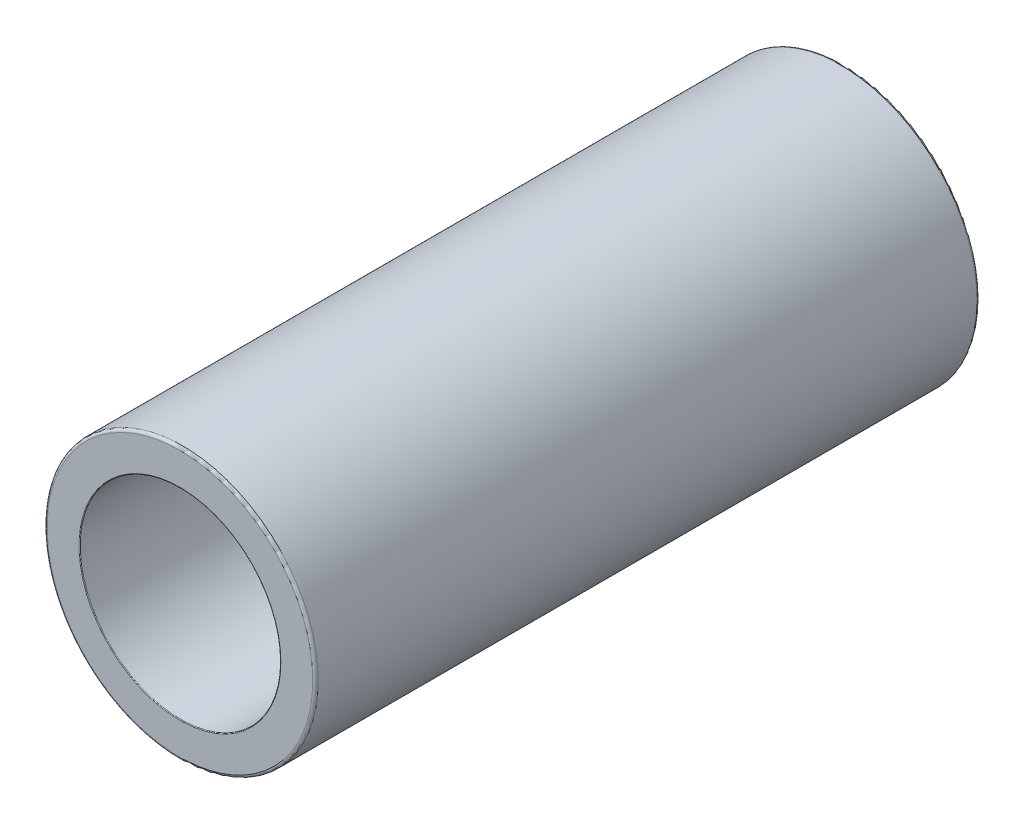
ISO-10303-21;
HEADER;
FILE_DESCRIPTION(('STEP AP214'),'2;1');
FILE_NAME('part.step','',(''),(''),'','','');
FILE_SCHEMA(('AUTOMOTIVE_DESIGN { 1 0 10303 214 1 1 1 1 }'));
ENDSEC;
DATA;
#1=APPLICATION_CONTEXT('core data for automotive mechanical design processes');
#2=APPLICATION_PROTOCOL_DEFINITION('international standard','automotive_design',2000,#1);
#3=PRODUCT_CONTEXT('',#1,'mechanical');
#4=PRODUCT('Part','Part','',(#3));
#5=PRODUCT_RELATED_PRODUCT_CATEGORY('part','',(#4));
#6=PRODUCT_DEFINITION_FORMATION('','',#4);
#7=PRODUCT_DEFINITION_CONTEXT('part definition',#1,'design');
#8=PRODUCT_DEFINITION('design','',#6,#7);
#9=PRODUCT_DEFINITION_SHAPE('','',#8);
#10=(LENGTH_UNIT() NAMED_UNIT(*) SI_UNIT(.MILLI.,.METRE.));
#11=(NAMED_UNIT(*) PLANE_ANGLE_UNIT() SI_UNIT($,.RADIAN.));
#12=(NAMED_UNIT(*) SI_UNIT($,.STERADIAN.) SOLID_ANGLE_UNIT());
#13=UNCERTAINTY_MEASURE_WITH_UNIT(LENGTH_MEASURE(1.E-05),#10,'distance_accuracy_value','');
#14=(GEOMETRIC_REPRESENTATION_CONTEXT(3) GLOBAL_UNCERTAINTY_ASSIGNED_CONTEXT((#13)) GLOBAL_UNIT_ASSIGNED_CONTEXT((#10,
#11,#12)) REPRESENTATION_CONTEXT('',''));
#15=CARTESIAN_POINT('',(0.,0.,0.));
#16=DIRECTION('',(0.,0.,1.));
#17=DIRECTION('',(1.,0.,0.));
#18=AXIS2_PLACEMENT_3D('',#15,#16,#17);
#19=CARTESIAN_POINT('',(0.,0.,49.));
#20=DIRECTION('',(0.,0.,1.));
#21=DIRECTION('',(1.,0.,0.));
#22=AXIS2_PLACEMENT_3D('',#19,#20,#21);
#23=PLANE('',#22);
#24=CARTESIAN_POINT('',(0.,0.,49.));
#25=DIRECTION('',(0.,0.,1.));
#26=DIRECTION('',(1.,0.,0.));
#27=AXIS2_PLACEMENT_3D('',#24,#25,#26);
#28=CIRCLE('',#27,7.45);
#29=CARTESIAN_POINT('',(7.45,0.,49.));
#30=VERTEX_POINT('',#29);
#31=EDGE_CURVE('E10',#30,#30,#28,.F.);
#32=ORIENTED_EDGE('',*,*,#31,.T.);
#33=EDGE_LOOP('',(#32));
#34=FACE_BOUND('',#33,.T.);
#35=CARTESIAN_POINT('',(0.,0.,49.));
#36=DIRECTION('',(0.,0.,1.));
#37=DIRECTION('',(1.,0.,0.));
#38=AXIS2_PLACEMENT_3D('',#35,#36,#37);
#39=CIRCLE('',#38,9.8);
#40=CARTESIAN_POINT('',(9.8,0.,49.));
#41=VERTEX_POINT('',#40);
#42=EDGE_CURVE('E52',#41,#41,#39,.T.);
#43=ORIENTED_EDGE('',*,*,#42,.T.);
#44=EDGE_LOOP('',(#43));
#45=FACE_BOUND('',#44,.T.);
#46=ADVANCED_FACE('F32',(#34,#45),#23,.T.);
#47=CARTESIAN_POINT('',(0.,0.,0.));
#48=DIRECTION('',(0.,0.,1.));
#49=DIRECTION('',(1.,0.,0.));
#50=AXIS2_PLACEMENT_3D('',#47,#48,#49);
#51=PLANE('',#50);
#52=CARTESIAN_POINT('',(0.,0.,0.));
#53=DIRECTION('',(0.,0.,1.));
#54=DIRECTION('',(1.,0.,0.));
#55=AXIS2_PLACEMENT_3D('',#52,#53,#54);
#56=CIRCLE('',#55,7.45);
#57=CARTESIAN_POINT('',(7.45,0.,0.));
#58=VERTEX_POINT('',#57);
#59=EDGE_CURVE('E47',#58,#58,#56,.T.);
#60=ORIENTED_EDGE('',*,*,#59,.T.);
#61=EDGE_LOOP('',(#60));
#62=FACE_BOUND('',#61,.T.);
#63=CARTESIAN_POINT('',(0.,0.,0.));
#64=DIRECTION('',(0.,0.,1.));
#65=DIRECTION('',(1.,0.,0.));
#66=AXIS2_PLACEMENT_3D('',#63,#64,#65);
#67=CIRCLE('',#66,9.8);
#68=CARTESIAN_POINT('',(9.8,0.,0.));
#69=VERTEX_POINT('',#68);
#70=EDGE_CURVE('E55',#69,#69,#67,.F.);
#71=ORIENTED_EDGE('',*,*,#70,.T.);
#72=EDGE_LOOP('',(#71));
#73=FACE_BOUND('',#72,.T.);
#74=ADVANCED_FACE('F76',(#62,#73),#51,.F.);
#75=CARTESIAN_POINT('',(0.,0.,49.));
#76=DIRECTION('',(0.,0.,-1.));
#77=DIRECTION('',(-1.,0.,0.));
#78=AXIS2_PLACEMENT_3D('',#75,#76,#77);
#79=CYLINDRICAL_SURFACE('',#78,10.);
#80=CARTESIAN_POINT('',(0.,0.,0.199999999999999));
#81=DIRECTION('',(0.,0.,1.));
#82=DIRECTION('',(1.,0.,0.));
#83=AXIS2_PLACEMENT_3D('',#80,#81,#82);
#84=CIRCLE('',#83,10.);
#85=CARTESIAN_POINT('',(10.,0.,0.199999999999999));
#86=VERTEX_POINT('',#85);
#87=EDGE_CURVE('E58',#86,#86,#84,.T.);
#88=ORIENTED_EDGE('',*,*,#87,.T.);
#89=EDGE_LOOP('',(#88));
#90=FACE_BOUND('',#89,.T.);
#91=CARTESIAN_POINT('',(0.,0.,48.8));
#92=DIRECTION('',(0.,0.,1.));
#93=DIRECTION('',(1.,0.,0.));
#94=AXIS2_PLACEMENT_3D('',#91,#92,#93);
#95=CIRCLE('',#94,10.);
#96=CARTESIAN_POINT('',(10.,0.,48.8));
#97=VERTEX_POINT('',#96);
#98=EDGE_CURVE('E61',#97,#97,#95,.F.);
#99=ORIENTED_EDGE('',*,*,#98,.T.);
#100=EDGE_LOOP('',(#99));
#101=FACE_BOUND('',#100,.T.);
#102=ADVANCED_FACE('F65',(#90,#101),#79,.T.);
#103=CARTESIAN_POINT('',(0.,0.,49.));
#104=DIRECTION('',(0.,0.,-1.));
#105=DIRECTION('',(-1.,0.,0.));
#106=AXIS2_PLACEMENT_3D('',#103,#104,#105);
#107=CYLINDRICAL_SURFACE('',#106,7.4);
#108=CARTESIAN_POINT('',(0.,0.,0.0500000000000014));
#109=DIRECTION('',(0.,0.,1.));
#110=DIRECTION('',(1.,0.,0.));
#111=AXIS2_PLACEMENT_3D('',#108,#109,#110);
#112=CIRCLE('',#111,7.4);
#113=CARTESIAN_POINT('',(7.4,0.,0.0500000000000014));
#114=VERTEX_POINT('',#113);
#115=EDGE_CURVE('E39',#114,#114,#112,.F.);
#116=ORIENTED_EDGE('',*,*,#115,.T.);
#117=EDGE_LOOP('',(#116));
#118=FACE_BOUND('',#117,.T.);
#119=CARTESIAN_POINT('',(0.,0.,48.95));
#120=DIRECTION('',(0.,0.,1.));
#121=DIRECTION('',(1.,0.,0.));
#122=AXIS2_PLACEMENT_3D('',#119,#120,#121);
#123=CIRCLE('',#122,7.4);
#124=CARTESIAN_POINT('',(7.4,0.,48.95));
#125=VERTEX_POINT('',#124);
#126=EDGE_CURVE('E43',#125,#125,#123,.T.);
#127=ORIENTED_EDGE('',*,*,#126,.T.);
#128=EDGE_LOOP('',(#127));
#129=FACE_BOUND('',#128,.T.);
#130=ADVANCED_FACE('F84',(#118,#129),#107,.F.);
#131=CARTESIAN_POINT('',(0.,0.,0.199999999999999));
#132=DIRECTION('',(0.,0.,1.));
#133=DIRECTION('',(1.,0.,0.));
#134=AXIS2_PLACEMENT_3D('',#131,#132,#133);
#135=TOROIDAL_SURFACE('',#134,9.8,0.2);
#136=ORIENTED_EDGE('',*,*,#70,.F.);
#137=EDGE_LOOP('',(#136));
#138=FACE_BOUND('',#137,.T.);
#139=ORIENTED_EDGE('',*,*,#87,.F.);
#140=EDGE_LOOP('',(#139));
#141=FACE_BOUND('',#140,.T.);
#142=ADVANCED_FACE('F71',(#138,#141),#135,.T.);
#143=CARTESIAN_POINT('',(0.,0.,48.8));
#144=DIRECTION('',(0.,0.,1.));
#145=DIRECTION('',(1.,0.,0.));
#146=AXIS2_PLACEMENT_3D('',#143,#144,#145);
#147=TOROIDAL_SURFACE('',#146,9.8,0.2);
#148=ORIENTED_EDGE('',*,*,#98,.F.);
#149=EDGE_LOOP('',(#148));
#150=FACE_BOUND('',#149,.T.);
#151=ORIENTED_EDGE('',*,*,#42,.F.);
#152=EDGE_LOOP('',(#151));
#153=FACE_BOUND('',#152,.T.);
#154=ADVANCED_FACE('F67',(#150,#153),#147,.T.);
#155=CARTESIAN_POINT('',(0.,0.,0.0500000000000014));
#156=DIRECTION('',(0.,0.,1.));
#157=DIRECTION('',(1.,0.,0.));
#158=AXIS2_PLACEMENT_3D('',#155,#156,#157);
#159=TOROIDAL_SURFACE('',#158,7.45,0.05);
#160=ORIENTED_EDGE('',*,*,#115,.F.);
#161=EDGE_LOOP('',(#160));
#162=FACE_BOUND('',#161,.T.);
#163=ORIENTED_EDGE('',*,*,#59,.F.);
#164=EDGE_LOOP('',(#163));
#165=FACE_BOUND('',#164,.T.);
#166=ADVANCED_FACE('F70',(#162,#165),#159,.T.);
#167=CARTESIAN_POINT('',(0.,0.,48.95));
#168=DIRECTION('',(0.,0.,1.));
#169=DIRECTION('',(1.,0.,0.));
#170=AXIS2_PLACEMENT_3D('',#167,#168,#169);
#171=TOROIDAL_SURFACE('',#170,7.45,0.05);
#172=ORIENTED_EDGE('',*,*,#31,.F.);
#173=EDGE_LOOP('',(#172));
#174=FACE_BOUND('',#173,.T.);
#175=ORIENTED_EDGE('',*,*,#126,.F.);
#176=EDGE_LOOP('',(#175));
#177=FACE_BOUND('',#176,.T.);
#178=ADVANCED_FACE('F34',(#174,#177),#171,.T.);
#179=CLOSED_SHELL('',(#46,#74,#102,#130,#142,#154,#166,#178));
#180=MANIFOLD_SOLID_BREP('B2',#179);
#181=ADVANCED_BREP_SHAPE_REPRESENTATION('',(#18,#180),#14);
#182=SHAPE_DEFINITION_REPRESENTATION(#9,#181);
ENDSEC;
END-ISO-10303-21;
